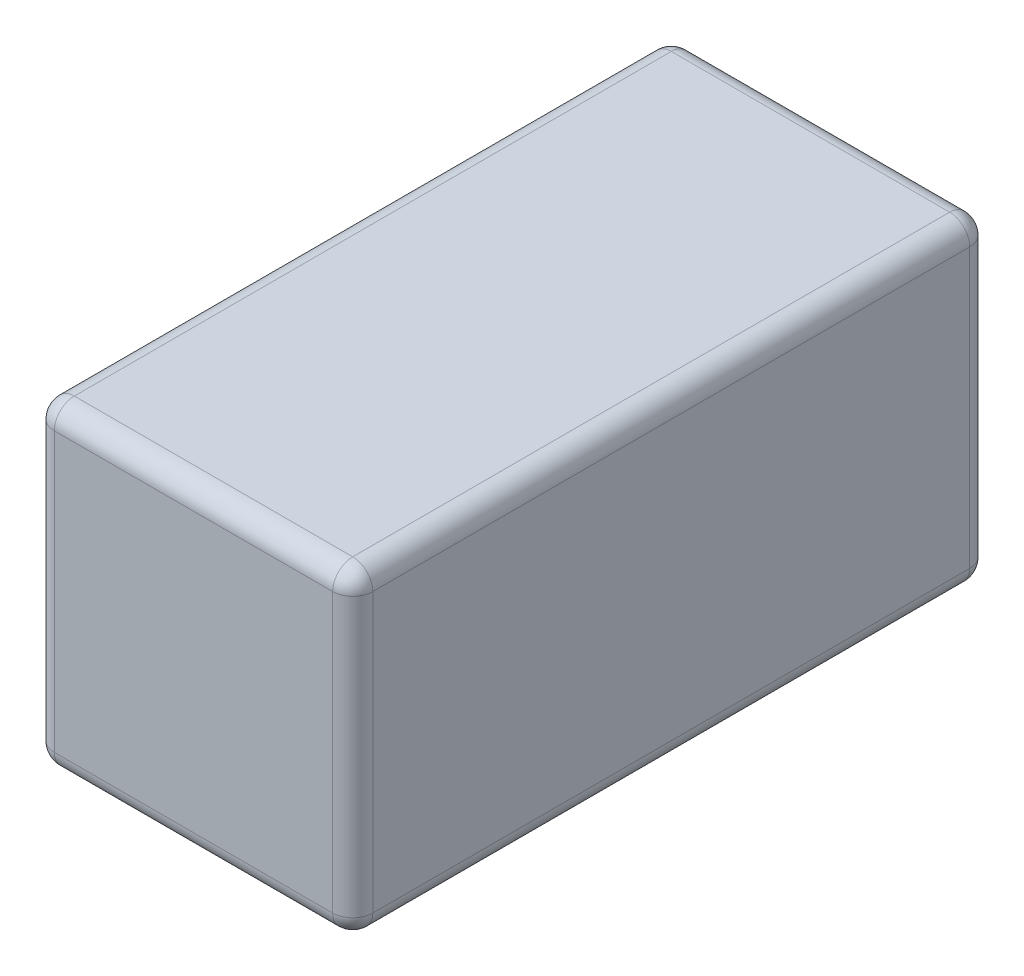
ISO-10303-21;
HEADER;
FILE_DESCRIPTION(('STEP AP214'),'2;1');
FILE_NAME('part.step','',(''),(''),'','','');
FILE_SCHEMA(('AUTOMOTIVE_DESIGN { 1 0 10303 214 1 1 1 1 }'));
ENDSEC;
DATA;
#1=APPLICATION_CONTEXT('core data for automotive mechanical design processes');
#2=APPLICATION_PROTOCOL_DEFINITION('international standard','automotive_design',2000,#1);
#3=PRODUCT_CONTEXT('',#1,'mechanical');
#4=PRODUCT('Part','Part','',(#3));
#5=PRODUCT_RELATED_PRODUCT_CATEGORY('part','',(#4));
#6=PRODUCT_DEFINITION_FORMATION('','',#4);
#7=PRODUCT_DEFINITION_CONTEXT('part definition',#1,'design');
#8=PRODUCT_DEFINITION('design','',#6,#7);
#9=PRODUCT_DEFINITION_SHAPE('','',#8);
#10=(LENGTH_UNIT() NAMED_UNIT(*) SI_UNIT(.MILLI.,.METRE.));
#11=(NAMED_UNIT(*) PLANE_ANGLE_UNIT() SI_UNIT($,.RADIAN.));
#12=(NAMED_UNIT(*) SI_UNIT($,.STERADIAN.) SOLID_ANGLE_UNIT());
#13=UNCERTAINTY_MEASURE_WITH_UNIT(LENGTH_MEASURE(1.E-05),#10,'distance_accuracy_value','');
#14=(GEOMETRIC_REPRESENTATION_CONTEXT(3) GLOBAL_UNCERTAINTY_ASSIGNED_CONTEXT((#13)) GLOBAL_UNIT_ASSIGNED_CONTEXT((#10,
#11,#12)) REPRESENTATION_CONTEXT('',''));
#15=CARTESIAN_POINT('',(0.,0.,0.));
#16=DIRECTION('',(0.,0.,1.));
#17=DIRECTION('',(1.,0.,0.));
#18=AXIS2_PLACEMENT_3D('',#15,#16,#17);
#19=CARTESIAN_POINT('',(0.79375,-0.79375,3.175));
#20=DIRECTION('',(-1.,0.,0.));
#21=DIRECTION('',(0.,0.,1.));
#22=AXIS2_PLACEMENT_3D('',#19,#20,#21);
#23=PLANE('',#22);
#24=DIRECTION('',(0.,1.,0.));
#25=VECTOR('',#24,1.);
#26=CARTESIAN_POINT('',(0.79375,-0.79375,3.075));
#27=LINE('',#26,#25);
#28=CARTESIAN_POINT('',(0.79375,0.69375,3.075));
#29=VERTEX_POINT('',#28);
#30=CARTESIAN_POINT('',(0.79375,-0.69375,3.075));
#31=VERTEX_POINT('',#30);
#32=EDGE_CURVE('E189',#29,#31,#27,.F.);
#33=ORIENTED_EDGE('',*,*,#32,.T.);
#34=DIRECTION('',(0.,0.,-1.));
#35=VECTOR('',#34,1.);
#36=CARTESIAN_POINT('',(0.79375,-0.69375,3.175));
#37=LINE('',#36,#35);
#38=CARTESIAN_POINT('',(0.79375,-0.69375,0.0999999999999998));
#39=VERTEX_POINT('',#38);
#40=EDGE_CURVE('E143',#31,#39,#37,.T.);
#41=ORIENTED_EDGE('',*,*,#40,.T.);
#42=DIRECTION('',(0.,1.,0.));
#43=VECTOR('',#42,1.);
#44=CARTESIAN_POINT('',(0.79375,0.79375,0.0999999999999998));
#45=LINE('',#44,#43);
#46=CARTESIAN_POINT('',(0.79375,0.69375,0.0999999999999998));
#47=VERTEX_POINT('',#46);
#48=EDGE_CURVE('E191',#39,#47,#45,.T.);
#49=ORIENTED_EDGE('',*,*,#48,.T.);
#50=DIRECTION('',(0.,0.,-1.));
#51=VECTOR('',#50,1.);
#52=CARTESIAN_POINT('',(0.79375,0.69375,3.175));
#53=LINE('',#52,#51);
#54=EDGE_CURVE('E187',#47,#29,#53,.F.);
#55=ORIENTED_EDGE('',*,*,#54,.T.);
#56=EDGE_LOOP('',(#33,#41,#49,#55));
#57=FACE_BOUND('',#56,.T.);
#58=ADVANCED_FACE('F37',(#57),#23,.F.);
#59=CARTESIAN_POINT('',(-0.79375,0.79375,3.175));
#60=DIRECTION('',(0.,-1.,0.));
#61=DIRECTION('',(0.,0.,-1.));
#62=AXIS2_PLACEMENT_3D('',#59,#60,#61);
#63=PLANE('',#62);
#64=DIRECTION('',(-1.,0.,0.));
#65=VECTOR('',#64,1.);
#66=CARTESIAN_POINT('',(-0.79375,0.79375,3.075));
#67=LINE('',#66,#65);
#68=CARTESIAN_POINT('',(-0.69375,0.79375,3.075));
#69=VERTEX_POINT('',#68);
#70=CARTESIAN_POINT('',(0.69375,0.79375,3.075));
#71=VERTEX_POINT('',#70);
#72=EDGE_CURVE('E46',#69,#71,#67,.F.);
#73=ORIENTED_EDGE('',*,*,#72,.T.);
#74=DIRECTION('',(0.,0.,-1.));
#75=VECTOR('',#74,1.);
#76=CARTESIAN_POINT('',(0.69375,0.79375,3.175));
#77=LINE('',#76,#75);
#78=CARTESIAN_POINT('',(0.69375,0.79375,0.0999999999999998));
#79=VERTEX_POINT('',#78);
#80=EDGE_CURVE('E11',#71,#79,#77,.T.);
#81=ORIENTED_EDGE('',*,*,#80,.T.);
#82=DIRECTION('',(-1.,0.,0.));
#83=VECTOR('',#82,1.);
#84=CARTESIAN_POINT('',(-0.79375,0.79375,0.0999999999999998));
#85=LINE('',#84,#83);
#86=CARTESIAN_POINT('',(-0.69375,0.79375,0.0999999999999998));
#87=VERTEX_POINT('',#86);
#88=EDGE_CURVE('E203',#79,#87,#85,.T.);
#89=ORIENTED_EDGE('',*,*,#88,.T.);
#90=DIRECTION('',(0.,0.,-1.));
#91=VECTOR('',#90,1.);
#92=CARTESIAN_POINT('',(-0.69375,0.79375,3.175));
#93=LINE('',#92,#91);
#94=EDGE_CURVE('E57',#87,#69,#93,.F.);
#95=ORIENTED_EDGE('',*,*,#94,.T.);
#96=EDGE_LOOP('',(#73,#81,#89,#95));
#97=FACE_BOUND('',#96,.T.);
#98=ADVANCED_FACE('F276',(#97),#63,.F.);
#99=CARTESIAN_POINT('',(-0.79375,-0.79375,3.175));
#100=DIRECTION('',(1.,0.,0.));
#101=DIRECTION('',(0.,0.,-1.));
#102=AXIS2_PLACEMENT_3D('',#99,#100,#101);
#103=PLANE('',#102);
#104=DIRECTION('',(0.,-1.,0.));
#105=VECTOR('',#104,1.);
#106=CARTESIAN_POINT('',(-0.79375,-0.79375,0.0999999999999998));
#107=LINE('',#106,#105);
#108=CARTESIAN_POINT('',(-0.79375,0.69375,0.0999999999999998));
#109=VERTEX_POINT('',#108);
#110=CARTESIAN_POINT('',(-0.79375,-0.69375,0.0999999999999998));
#111=VERTEX_POINT('',#110);
#112=EDGE_CURVE('E169',#109,#111,#107,.T.);
#113=ORIENTED_EDGE('',*,*,#112,.T.);
#114=DIRECTION('',(0.,0.,-1.));
#115=VECTOR('',#114,1.);
#116=CARTESIAN_POINT('',(-0.79375,-0.69375,3.175));
#117=LINE('',#116,#115);
#118=CARTESIAN_POINT('',(-0.79375,-0.69375,3.075));
#119=VERTEX_POINT('',#118);
#120=EDGE_CURVE('E175',#111,#119,#117,.F.);
#121=ORIENTED_EDGE('',*,*,#120,.T.);
#122=DIRECTION('',(0.,-1.,0.));
#123=VECTOR('',#122,1.);
#124=CARTESIAN_POINT('',(-0.79375,-0.79375,3.075));
#125=LINE('',#124,#123);
#126=CARTESIAN_POINT('',(-0.79375,0.69375,3.075));
#127=VERTEX_POINT('',#126);
#128=EDGE_CURVE('E173',#119,#127,#125,.F.);
#129=ORIENTED_EDGE('',*,*,#128,.T.);
#130=DIRECTION('',(0.,0.,-1.));
#131=VECTOR('',#130,1.);
#132=CARTESIAN_POINT('',(-0.79375,0.69375,3.175));
#133=LINE('',#132,#131);
#134=EDGE_CURVE('E171',#127,#109,#133,.T.);
#135=ORIENTED_EDGE('',*,*,#134,.T.);
#136=EDGE_LOOP('',(#113,#121,#129,#135));
#137=FACE_BOUND('',#136,.T.);
#138=ADVANCED_FACE('F336',(#137),#103,.F.);
#139=CARTESIAN_POINT('',(-0.79375,-0.79375,3.175));
#140=DIRECTION('',(0.,1.,0.));
#141=DIRECTION('',(0.,0.,1.));
#142=AXIS2_PLACEMENT_3D('',#139,#140,#141);
#143=PLANE('',#142);
#144=DIRECTION('',(1.,0.,0.));
#145=VECTOR('',#144,1.);
#146=CARTESIAN_POINT('',(-0.79375,-0.79375,3.075));
#147=LINE('',#146,#145);
#148=CARTESIAN_POINT('',(0.69375,-0.79375,3.075));
#149=VERTEX_POINT('',#148);
#150=CARTESIAN_POINT('',(-0.69375,-0.79375,3.075));
#151=VERTEX_POINT('',#150);
#152=EDGE_CURVE('E129',#149,#151,#147,.F.);
#153=ORIENTED_EDGE('',*,*,#152,.T.);
#154=DIRECTION('',(0.,0.,-1.));
#155=VECTOR('',#154,1.);
#156=CARTESIAN_POINT('',(-0.69375,-0.79375,3.175));
#157=LINE('',#156,#155);
#158=CARTESIAN_POINT('',(-0.69375,-0.79375,0.0999999999999998));
#159=VERTEX_POINT('',#158);
#160=EDGE_CURVE('E167',#151,#159,#157,.T.);
#161=ORIENTED_EDGE('',*,*,#160,.T.);
#162=DIRECTION('',(1.,0.,0.));
#163=VECTOR('',#162,1.);
#164=CARTESIAN_POINT('',(0.79375,-0.79375,0.0999999999999998));
#165=LINE('',#164,#163);
#166=CARTESIAN_POINT('',(0.69375,-0.79375,0.0999999999999998));
#167=VERTEX_POINT('',#166);
#168=EDGE_CURVE('E132',#159,#167,#165,.T.);
#169=ORIENTED_EDGE('',*,*,#168,.T.);
#170=DIRECTION('',(0.,0.,-1.));
#171=VECTOR('',#170,1.);
#172=CARTESIAN_POINT('',(0.69375,-0.79375,3.175));
#173=LINE('',#172,#171);
#174=EDGE_CURVE('E124',#167,#149,#173,.F.);
#175=ORIENTED_EDGE('',*,*,#174,.T.);
#176=EDGE_LOOP('',(#153,#161,#169,#175));
#177=FACE_BOUND('',#176,.T.);
#178=ADVANCED_FACE('F126',(#177),#143,.F.);
#179=CARTESIAN_POINT('',(0.,0.,3.175));
#180=DIRECTION('',(0.,0.,-1.));
#181=DIRECTION('',(-1.,0.,0.));
#182=AXIS2_PLACEMENT_3D('',#179,#180,#181);
#183=PLANE('',#182);
#184=DIRECTION('',(0.,-1.,0.));
#185=VECTOR('',#184,1.);
#186=CARTESIAN_POINT('',(-0.69375,0.,3.175));
#187=LINE('',#186,#185);
#188=CARTESIAN_POINT('',(-0.69375,0.69375,3.175));
#189=VERTEX_POINT('',#188);
#190=CARTESIAN_POINT('',(-0.69375,-0.69375,3.175));
#191=VERTEX_POINT('',#190);
#192=EDGE_CURVE('E198',#189,#191,#187,.T.);
#193=ORIENTED_EDGE('',*,*,#192,.T.);
#194=DIRECTION('',(1.,0.,0.));
#195=VECTOR('',#194,1.);
#196=CARTESIAN_POINT('',(0.,-0.69375,3.175));
#197=LINE('',#196,#195);
#198=CARTESIAN_POINT('',(0.69375,-0.69375,3.175));
#199=VERTEX_POINT('',#198);
#200=EDGE_CURVE('E200',#191,#199,#197,.T.);
#201=ORIENTED_EDGE('',*,*,#200,.T.);
#202=DIRECTION('',(0.,1.,0.));
#203=VECTOR('',#202,1.);
#204=CARTESIAN_POINT('',(0.69375,0.,3.175));
#205=LINE('',#204,#203);
#206=CARTESIAN_POINT('',(0.69375,0.69375,3.175));
#207=VERTEX_POINT('',#206);
#208=EDGE_CURVE('E196',#199,#207,#205,.T.);
#209=ORIENTED_EDGE('',*,*,#208,.T.);
#210=DIRECTION('',(-1.,0.,0.));
#211=VECTOR('',#210,1.);
#212=CARTESIAN_POINT('',(0.,0.69375,3.175));
#213=LINE('',#212,#211);
#214=EDGE_CURVE('E194',#207,#189,#213,.T.);
#215=ORIENTED_EDGE('',*,*,#214,.T.);
#216=EDGE_LOOP('',(#193,#201,#209,#215));
#217=FACE_BOUND('',#216,.T.);
#218=ADVANCED_FACE('F301',(#217),#183,.F.);
#219=CARTESIAN_POINT('',(0.,0.,0.));
#220=DIRECTION('',(0.,0.,-1.));
#221=DIRECTION('',(-1.,0.,0.));
#222=AXIS2_PLACEMENT_3D('',#219,#220,#221);
#223=PLANE('',#222);
#224=DIRECTION('',(0.,1.,0.));
#225=VECTOR('',#224,1.);
#226=CARTESIAN_POINT('',(0.69375,-0.79375,0.));
#227=LINE('',#226,#225);
#228=CARTESIAN_POINT('',(0.69375,0.69375,0.));
#229=VERTEX_POINT('',#228);
#230=CARTESIAN_POINT('',(0.69375,-0.69375,0.));
#231=VERTEX_POINT('',#230);
#232=EDGE_CURVE('E182',#229,#231,#227,.F.);
#233=ORIENTED_EDGE('',*,*,#232,.T.);
#234=DIRECTION('',(1.,0.,0.));
#235=VECTOR('',#234,1.);
#236=CARTESIAN_POINT('',(-0.79375,-0.69375,0.));
#237=LINE('',#236,#235);
#238=CARTESIAN_POINT('',(-0.69375,-0.69375,0.));
#239=VERTEX_POINT('',#238);
#240=EDGE_CURVE('E184',#231,#239,#237,.F.);
#241=ORIENTED_EDGE('',*,*,#240,.T.);
#242=DIRECTION('',(0.,-1.,0.));
#243=VECTOR('',#242,1.);
#244=CARTESIAN_POINT('',(-0.69375,0.79375,0.));
#245=LINE('',#244,#243);
#246=CARTESIAN_POINT('',(-0.69375,0.69375,0.));
#247=VERTEX_POINT('',#246);
#248=EDGE_CURVE('E178',#239,#247,#245,.F.);
#249=ORIENTED_EDGE('',*,*,#248,.T.);
#250=DIRECTION('',(-1.,0.,0.));
#251=VECTOR('',#250,1.);
#252=CARTESIAN_POINT('',(0.79375,0.69375,0.));
#253=LINE('',#252,#251);
#254=EDGE_CURVE('E180',#247,#229,#253,.F.);
#255=ORIENTED_EDGE('',*,*,#254,.T.);
#256=EDGE_LOOP('',(#233,#241,#249,#255));
#257=FACE_BOUND('',#256,.T.);
#258=ADVANCED_FACE('F269',(#257),#223,.T.);
#259=CARTESIAN_POINT('',(0.69375,0.69375,3.175));
#260=DIRECTION('',(0.,0.,-1.));
#261=DIRECTION('',(-1.,0.,0.));
#262=AXIS2_PLACEMENT_3D('',#259,#260,#261);
#263=CYLINDRICAL_SURFACE('',#262,0.1);
#264=CARTESIAN_POINT('',(0.69375,0.69375,3.075));
#265=DIRECTION('',(0.,0.,1.));
#266=DIRECTION('',(1.,0.,0.));
#267=AXIS2_PLACEMENT_3D('',#264,#265,#266);
#268=CIRCLE('',#267,0.1);
#269=EDGE_CURVE('E41',#29,#71,#268,.T.);
#270=ORIENTED_EDGE('',*,*,#269,.F.);
#271=ORIENTED_EDGE('',*,*,#54,.F.);
#272=CARTESIAN_POINT('',(0.69375,0.69375,0.0999999999999998));
#273=DIRECTION('',(0.,0.,-1.));
#274=DIRECTION('',(-1.,0.,0.));
#275=AXIS2_PLACEMENT_3D('',#272,#273,#274);
#276=CIRCLE('',#275,0.1);
#277=EDGE_CURVE('E164',#79,#47,#276,.T.);
#278=ORIENTED_EDGE('',*,*,#277,.F.);
#279=ORIENTED_EDGE('',*,*,#80,.F.);
#280=EDGE_LOOP('',(#270,#271,#278,#279));
#281=FACE_BOUND('',#280,.T.);
#282=ADVANCED_FACE('F39',(#281),#263,.T.);
#283=CARTESIAN_POINT('',(0.69375,0.69375,3.075));
#284=DIRECTION('',(0.,1.,0.));
#285=DIRECTION('',(0.,0.,1.));
#286=AXIS2_PLACEMENT_3D('',#283,#284,#285);
#287=SPHERICAL_SURFACE('',#286,0.1);
#288=CARTESIAN_POINT('',(0.69375,0.69375,3.075));
#289=DIRECTION('',(0.,1.,0.));
#290=DIRECTION('',(0.,0.,1.));
#291=AXIS2_PLACEMENT_3D('',#288,#289,#290);
#292=CIRCLE('',#291,0.1);
#293=EDGE_CURVE('E249',#29,#207,#292,.F.);
#294=ORIENTED_EDGE('',*,*,#293,.F.);
#295=ORIENTED_EDGE('',*,*,#269,.T.);
#296=CARTESIAN_POINT('',(0.69375,0.69375,3.075));
#297=DIRECTION('',(1.,0.,0.));
#298=DIRECTION('',(0.,0.,-1.));
#299=AXIS2_PLACEMENT_3D('',#296,#297,#298);
#300=CIRCLE('',#299,0.1);
#301=EDGE_CURVE('E252',#207,#71,#300,.F.);
#302=ORIENTED_EDGE('',*,*,#301,.F.);
#303=EDGE_LOOP('',(#294,#295,#302));
#304=FACE_BOUND('',#303,.T.);
#305=ADVANCED_FACE('F294',(#304),#287,.T.);
#306=CARTESIAN_POINT('',(0.69375,0.69375,0.1));
#307=DIRECTION('',(1.,0.,0.));
#308=DIRECTION('',(0.,0.,-1.));
#309=AXIS2_PLACEMENT_3D('',#306,#307,#308);
#310=SPHERICAL_SURFACE('',#309,0.1);
#311=CARTESIAN_POINT('',(0.69375,0.69375,0.1));
#312=DIRECTION('',(1.,0.,0.));
#313=DIRECTION('',(0.,0.,-1.));
#314=AXIS2_PLACEMENT_3D('',#311,#312,#313);
#315=CIRCLE('',#314,0.1);
#316=EDGE_CURVE('E243',#79,#229,#315,.F.);
#317=ORIENTED_EDGE('',*,*,#316,.F.);
#318=ORIENTED_EDGE('',*,*,#277,.T.);
#319=CARTESIAN_POINT('',(0.69375,0.69375,0.0999999999999998));
#320=DIRECTION('',(0.,1.,0.));
#321=DIRECTION('',(0.,0.,1.));
#322=AXIS2_PLACEMENT_3D('',#319,#320,#321);
#323=CIRCLE('',#322,0.1);
#324=EDGE_CURVE('E246',#229,#47,#323,.F.);
#325=ORIENTED_EDGE('',*,*,#324,.F.);
#326=EDGE_LOOP('',(#317,#318,#325));
#327=FACE_BOUND('',#326,.T.);
#328=ADVANCED_FACE('F259',(#327),#310,.T.);
#329=CARTESIAN_POINT('',(0.,0.69375,3.075));
#330=DIRECTION('',(-1.,0.,0.));
#331=DIRECTION('',(0.,0.,1.));
#332=AXIS2_PLACEMENT_3D('',#329,#330,#331);
#333=CYLINDRICAL_SURFACE('',#332,0.1);
#334=ORIENTED_EDGE('',*,*,#301,.T.);
#335=ORIENTED_EDGE('',*,*,#72,.F.);
#336=CARTESIAN_POINT('',(-0.69375,0.69375,3.075));
#337=DIRECTION('',(-1.,0.,0.));
#338=DIRECTION('',(0.,0.,1.));
#339=AXIS2_PLACEMENT_3D('',#336,#337,#338);
#340=CIRCLE('',#339,0.1);
#341=EDGE_CURVE('E237',#189,#69,#340,.T.);
#342=ORIENTED_EDGE('',*,*,#341,.F.);
#343=ORIENTED_EDGE('',*,*,#214,.F.);
#344=EDGE_LOOP('',(#334,#335,#342,#343));
#345=FACE_BOUND('',#344,.T.);
#346=ADVANCED_FACE('F290',(#345),#333,.T.);
#347=CARTESIAN_POINT('',(0.69375,0.,3.075));
#348=DIRECTION('',(0.,1.,0.));
#349=DIRECTION('',(0.,0.,1.));
#350=AXIS2_PLACEMENT_3D('',#347,#348,#349);
#351=CYLINDRICAL_SURFACE('',#350,0.1);
#352=ORIENTED_EDGE('',*,*,#293,.T.);
#353=ORIENTED_EDGE('',*,*,#208,.F.);
#354=CARTESIAN_POINT('',(0.69375,-0.69375,3.075));
#355=DIRECTION('',(0.,-1.,0.));
#356=DIRECTION('',(0.,0.,-1.));
#357=AXIS2_PLACEMENT_3D('',#354,#355,#356);
#358=CIRCLE('',#357,0.1);
#359=EDGE_CURVE('E147',#31,#199,#358,.T.);
#360=ORIENTED_EDGE('',*,*,#359,.F.);
#361=ORIENTED_EDGE('',*,*,#32,.F.);
#362=EDGE_LOOP('',(#352,#353,#360,#361));
#363=FACE_BOUND('',#362,.T.);
#364=ADVANCED_FACE('F299',(#363),#351,.T.);
#365=CARTESIAN_POINT('',(0.69375,-0.69375,3.175));
#366=DIRECTION('',(0.,0.,-1.));
#367=DIRECTION('',(-1.,0.,0.));
#368=AXIS2_PLACEMENT_3D('',#365,#366,#367);
#369=CYLINDRICAL_SURFACE('',#368,0.1);
#370=CARTESIAN_POINT('',(0.69375,-0.69375,0.0999999999999998));
#371=DIRECTION('',(0.,0.,-1.));
#372=DIRECTION('',(-1.,0.,0.));
#373=AXIS2_PLACEMENT_3D('',#370,#371,#372);
#374=CIRCLE('',#373,0.1);
#375=EDGE_CURVE('E148',#39,#167,#374,.T.);
#376=ORIENTED_EDGE('',*,*,#375,.F.);
#377=ORIENTED_EDGE('',*,*,#40,.F.);
#378=CARTESIAN_POINT('',(0.69375,-0.69375,3.075));
#379=DIRECTION('',(0.,0.,1.));
#380=DIRECTION('',(1.,0.,0.));
#381=AXIS2_PLACEMENT_3D('',#378,#379,#380);
#382=CIRCLE('',#381,0.1);
#383=EDGE_CURVE('E139',#149,#31,#382,.T.);
#384=ORIENTED_EDGE('',*,*,#383,.F.);
#385=ORIENTED_EDGE('',*,*,#174,.F.);
#386=EDGE_LOOP('',(#376,#377,#384,#385));
#387=FACE_BOUND('',#386,.T.);
#388=ADVANCED_FACE('F141',(#387),#369,.T.);
#389=CARTESIAN_POINT('',(0.69375,-0.79375,0.0999999999999998));
#390=DIRECTION('',(0.,-1.,0.));
#391=DIRECTION('',(0.,0.,-1.));
#392=AXIS2_PLACEMENT_3D('',#389,#390,#391);
#393=CYLINDRICAL_SURFACE('',#392,0.1);
#394=ORIENTED_EDGE('',*,*,#324,.T.);
#395=ORIENTED_EDGE('',*,*,#48,.F.);
#396=CARTESIAN_POINT('',(0.69375,-0.69375,0.1));
#397=DIRECTION('',(0.,-1.,0.));
#398=DIRECTION('',(0.,0.,-1.));
#399=AXIS2_PLACEMENT_3D('',#396,#397,#398);
#400=CIRCLE('',#399,0.1);
#401=EDGE_CURVE('E233',#231,#39,#400,.T.);
#402=ORIENTED_EDGE('',*,*,#401,.F.);
#403=ORIENTED_EDGE('',*,*,#232,.F.);
#404=EDGE_LOOP('',(#394,#395,#402,#403));
#405=FACE_BOUND('',#404,.T.);
#406=ADVANCED_FACE('F265',(#405),#393,.T.);
#407=CARTESIAN_POINT('',(-0.79375,0.69375,0.0999999999999998));
#408=DIRECTION('',(1.,0.,0.));
#409=DIRECTION('',(0.,0.,-1.));
#410=AXIS2_PLACEMENT_3D('',#407,#408,#409);
#411=CYLINDRICAL_SURFACE('',#410,0.1);
#412=ORIENTED_EDGE('',*,*,#316,.T.);
#413=ORIENTED_EDGE('',*,*,#254,.F.);
#414=CARTESIAN_POINT('',(-0.69375,0.69375,0.0999999999999998));
#415=DIRECTION('',(-1.,0.,0.));
#416=DIRECTION('',(0.,0.,1.));
#417=AXIS2_PLACEMENT_3D('',#414,#415,#416);
#418=CIRCLE('',#417,0.1);
#419=EDGE_CURVE('E230',#87,#247,#418,.T.);
#420=ORIENTED_EDGE('',*,*,#419,.F.);
#421=ORIENTED_EDGE('',*,*,#88,.F.);
#422=EDGE_LOOP('',(#412,#413,#420,#421));
#423=FACE_BOUND('',#422,.T.);
#424=ADVANCED_FACE('F275',(#423),#411,.T.);
#425=CARTESIAN_POINT('',(-0.69375,0.69375,3.175));
#426=DIRECTION('',(0.,0.,-1.));
#427=DIRECTION('',(-1.,0.,0.));
#428=AXIS2_PLACEMENT_3D('',#425,#426,#427);
#429=CYLINDRICAL_SURFACE('',#428,0.1);
#430=CARTESIAN_POINT('',(-0.69375,0.69375,3.075));
#431=DIRECTION('',(0.,0.,1.));
#432=DIRECTION('',(1.,0.,0.));
#433=AXIS2_PLACEMENT_3D('',#430,#431,#432);
#434=CIRCLE('',#433,0.1);
#435=EDGE_CURVE('E240',#69,#127,#434,.T.);
#436=ORIENTED_EDGE('',*,*,#435,.F.);
#437=ORIENTED_EDGE('',*,*,#94,.F.);
#438=CARTESIAN_POINT('',(-0.69375,0.69375,0.0999999999999998));
#439=DIRECTION('',(0.,0.,-1.));
#440=DIRECTION('',(-1.,0.,0.));
#441=AXIS2_PLACEMENT_3D('',#438,#439,#440);
#442=CIRCLE('',#441,0.1);
#443=EDGE_CURVE('E227',#109,#87,#442,.T.);
#444=ORIENTED_EDGE('',*,*,#443,.F.);
#445=ORIENTED_EDGE('',*,*,#134,.F.);
#446=EDGE_LOOP('',(#436,#437,#444,#445));
#447=FACE_BOUND('',#446,.T.);
#448=ADVANCED_FACE('F280',(#447),#429,.T.);
#449=CARTESIAN_POINT('',(-0.69375,0.69375,3.075));
#450=DIRECTION('',(0.,1.,0.));
#451=DIRECTION('',(0.,0.,1.));
#452=AXIS2_PLACEMENT_3D('',#449,#450,#451);
#453=SPHERICAL_SURFACE('',#452,0.1);
#454=ORIENTED_EDGE('',*,*,#341,.T.);
#455=ORIENTED_EDGE('',*,*,#435,.T.);
#456=CARTESIAN_POINT('',(-0.69375,0.69375,3.075));
#457=DIRECTION('',(0.,1.,0.));
#458=DIRECTION('',(0.,0.,1.));
#459=AXIS2_PLACEMENT_3D('',#456,#457,#458);
#460=CIRCLE('',#459,0.1);
#461=EDGE_CURVE('E155',#189,#127,#460,.F.);
#462=ORIENTED_EDGE('',*,*,#461,.F.);
#463=EDGE_LOOP('',(#454,#455,#462));
#464=FACE_BOUND('',#463,.T.);
#465=ADVANCED_FACE('F286',(#464),#453,.T.);
#466=CARTESIAN_POINT('',(0.69375,-0.69375,3.075));
#467=DIRECTION('',(1.,0.,0.));
#468=DIRECTION('',(0.,0.,-1.));
#469=AXIS2_PLACEMENT_3D('',#466,#467,#468);
#470=SPHERICAL_SURFACE('',#469,0.1);
#471=ORIENTED_EDGE('',*,*,#383,.T.);
#472=ORIENTED_EDGE('',*,*,#359,.T.);
#473=CARTESIAN_POINT('',(0.69375,-0.69375,3.075));
#474=DIRECTION('',(1.,0.,0.));
#475=DIRECTION('',(0.,0.,-1.));
#476=AXIS2_PLACEMENT_3D('',#473,#474,#475);
#477=CIRCLE('',#476,0.1);
#478=EDGE_CURVE('E150',#149,#199,#477,.F.);
#479=ORIENTED_EDGE('',*,*,#478,.F.);
#480=EDGE_LOOP('',(#471,#472,#479));
#481=FACE_BOUND('',#480,.T.);
#482=ADVANCED_FACE('F151',(#481),#470,.T.);
#483=CARTESIAN_POINT('',(0.69375,-0.69375,0.1));
#484=DIRECTION('',(1.,0.,0.));
#485=DIRECTION('',(0.,0.,-1.));
#486=AXIS2_PLACEMENT_3D('',#483,#484,#485);
#487=SPHERICAL_SURFACE('',#486,0.1);
#488=ORIENTED_EDGE('',*,*,#401,.T.);
#489=ORIENTED_EDGE('',*,*,#375,.T.);
#490=CARTESIAN_POINT('',(0.69375,-0.69375,0.0999999999999998));
#491=DIRECTION('',(1.,0.,0.));
#492=DIRECTION('',(0.,0.,-1.));
#493=AXIS2_PLACEMENT_3D('',#490,#491,#492);
#494=CIRCLE('',#493,0.1);
#495=EDGE_CURVE('E156',#231,#167,#494,.F.);
#496=ORIENTED_EDGE('',*,*,#495,.F.);
#497=EDGE_LOOP('',(#488,#489,#496));
#498=FACE_BOUND('',#497,.T.);
#499=ADVANCED_FACE('F320',(#498),#487,.T.);
#500=CARTESIAN_POINT('',(-0.69375,0.69375,0.1));
#501=DIRECTION('',(0.,1.,0.));
#502=DIRECTION('',(0.,0.,1.));
#503=AXIS2_PLACEMENT_3D('',#500,#501,#502);
#504=SPHERICAL_SURFACE('',#503,0.1);
#505=ORIENTED_EDGE('',*,*,#443,.T.);
#506=ORIENTED_EDGE('',*,*,#419,.T.);
#507=CARTESIAN_POINT('',(-0.69375,0.69375,0.1));
#508=DIRECTION('',(0.,1.,0.));
#509=DIRECTION('',(0.,0.,1.));
#510=AXIS2_PLACEMENT_3D('',#507,#508,#509);
#511=CIRCLE('',#510,0.1);
#512=EDGE_CURVE('E220',#109,#247,#511,.F.);
#513=ORIENTED_EDGE('',*,*,#512,.F.);
#514=EDGE_LOOP('',(#505,#506,#513));
#515=FACE_BOUND('',#514,.T.);
#516=ADVANCED_FACE('F322',(#515),#504,.T.);
#517=CARTESIAN_POINT('',(-0.69375,0.,3.075));
#518=DIRECTION('',(0.,-1.,0.));
#519=DIRECTION('',(0.,0.,-1.));
#520=AXIS2_PLACEMENT_3D('',#517,#518,#519);
#521=CYLINDRICAL_SURFACE('',#520,0.1);
#522=ORIENTED_EDGE('',*,*,#461,.T.);
#523=ORIENTED_EDGE('',*,*,#128,.F.);
#524=CARTESIAN_POINT('',(-0.69375,-0.69375,3.075));
#525=DIRECTION('',(0.,-1.,0.));
#526=DIRECTION('',(0.,0.,-1.));
#527=AXIS2_PLACEMENT_3D('',#524,#525,#526);
#528=CIRCLE('',#527,0.1);
#529=EDGE_CURVE('E217',#191,#119,#528,.T.);
#530=ORIENTED_EDGE('',*,*,#529,.F.);
#531=ORIENTED_EDGE('',*,*,#192,.F.);
#532=EDGE_LOOP('',(#522,#523,#530,#531));
#533=FACE_BOUND('',#532,.T.);
#534=ADVANCED_FACE('F305',(#533),#521,.T.);
#535=CARTESIAN_POINT('',(0.,-0.69375,3.075));
#536=DIRECTION('',(1.,0.,0.));
#537=DIRECTION('',(0.,0.,-1.));
#538=AXIS2_PLACEMENT_3D('',#535,#536,#537);
#539=CYLINDRICAL_SURFACE('',#538,0.1);
#540=ORIENTED_EDGE('',*,*,#478,.T.);
#541=ORIENTED_EDGE('',*,*,#200,.F.);
#542=CARTESIAN_POINT('',(-0.69375,-0.69375,3.075));
#543=DIRECTION('',(-1.,0.,0.));
#544=DIRECTION('',(0.,0.,1.));
#545=AXIS2_PLACEMENT_3D('',#542,#543,#544);
#546=CIRCLE('',#545,0.1);
#547=EDGE_CURVE('E160',#151,#191,#546,.T.);
#548=ORIENTED_EDGE('',*,*,#547,.F.);
#549=ORIENTED_EDGE('',*,*,#152,.F.);
#550=EDGE_LOOP('',(#540,#541,#548,#549));
#551=FACE_BOUND('',#550,.T.);
#552=ADVANCED_FACE('F158',(#551),#539,.T.);
#553=CARTESIAN_POINT('',(-0.79375,-0.69375,0.0999999999999998));
#554=DIRECTION('',(-1.,0.,0.));
#555=DIRECTION('',(0.,0.,1.));
#556=AXIS2_PLACEMENT_3D('',#553,#554,#555);
#557=CYLINDRICAL_SURFACE('',#556,0.1);
#558=ORIENTED_EDGE('',*,*,#495,.T.);
#559=ORIENTED_EDGE('',*,*,#168,.F.);
#560=CARTESIAN_POINT('',(-0.69375,-0.69375,0.1));
#561=DIRECTION('',(-1.,0.,0.));
#562=DIRECTION('',(0.,0.,1.));
#563=AXIS2_PLACEMENT_3D('',#560,#561,#562);
#564=CIRCLE('',#563,0.1);
#565=EDGE_CURVE('E213',#239,#159,#564,.T.);
#566=ORIENTED_EDGE('',*,*,#565,.F.);
#567=ORIENTED_EDGE('',*,*,#240,.F.);
#568=EDGE_LOOP('',(#558,#559,#566,#567));
#569=FACE_BOUND('',#568,.T.);
#570=ADVANCED_FACE('F318',(#569),#557,.T.);
#571=CARTESIAN_POINT('',(-0.69375,-0.79375,0.0999999999999998));
#572=DIRECTION('',(0.,1.,0.));
#573=DIRECTION('',(0.,0.,1.));
#574=AXIS2_PLACEMENT_3D('',#571,#572,#573);
#575=CYLINDRICAL_SURFACE('',#574,0.1);
#576=ORIENTED_EDGE('',*,*,#512,.T.);
#577=ORIENTED_EDGE('',*,*,#248,.F.);
#578=CARTESIAN_POINT('',(-0.69375,-0.69375,0.0999999999999998));
#579=DIRECTION('',(0.,-1.,0.));
#580=DIRECTION('',(0.,0.,-1.));
#581=AXIS2_PLACEMENT_3D('',#578,#579,#580);
#582=CIRCLE('',#581,0.1);
#583=EDGE_CURVE('E211',#111,#239,#582,.T.);
#584=ORIENTED_EDGE('',*,*,#583,.F.);
#585=ORIENTED_EDGE('',*,*,#112,.F.);
#586=EDGE_LOOP('',(#576,#577,#584,#585));
#587=FACE_BOUND('',#586,.T.);
#588=ADVANCED_FACE('F346',(#587),#575,.T.);
#589=CARTESIAN_POINT('',(-0.69375,-0.69375,3.075));
#590=DIRECTION('',(0.,0.,1.));
#591=DIRECTION('',(1.,0.,0.));
#592=AXIS2_PLACEMENT_3D('',#589,#590,#591);
#593=SPHERICAL_SURFACE('',#592,0.1);
#594=ORIENTED_EDGE('',*,*,#547,.T.);
#595=ORIENTED_EDGE('',*,*,#529,.T.);
#596=CARTESIAN_POINT('',(-0.69375,-0.69375,3.075));
#597=DIRECTION('',(0.,0.,1.));
#598=DIRECTION('',(1.,0.,0.));
#599=AXIS2_PLACEMENT_3D('',#596,#597,#598);
#600=CIRCLE('',#599,0.1);
#601=EDGE_CURVE('E209',#151,#119,#600,.F.);
#602=ORIENTED_EDGE('',*,*,#601,.F.);
#603=EDGE_LOOP('',(#594,#595,#602));
#604=FACE_BOUND('',#603,.T.);
#605=ADVANCED_FACE('F307',(#604),#593,.T.);
#606=CARTESIAN_POINT('',(-0.69375,-0.69375,0.1));
#607=DIRECTION('',(0.,0.,-1.));
#608=DIRECTION('',(-1.,0.,0.));
#609=AXIS2_PLACEMENT_3D('',#606,#607,#608);
#610=SPHERICAL_SURFACE('',#609,0.1);
#611=ORIENTED_EDGE('',*,*,#583,.T.);
#612=ORIENTED_EDGE('',*,*,#565,.T.);
#613=CARTESIAN_POINT('',(-0.69375,-0.69375,0.0999999999999998));
#614=DIRECTION('',(0.,0.,-1.));
#615=DIRECTION('',(-1.,0.,0.));
#616=AXIS2_PLACEMENT_3D('',#613,#614,#615);
#617=CIRCLE('',#616,0.1);
#618=EDGE_CURVE('E207',#111,#159,#617,.F.);
#619=ORIENTED_EDGE('',*,*,#618,.F.);
#620=EDGE_LOOP('',(#611,#612,#619));
#621=FACE_BOUND('',#620,.T.);
#622=ADVANCED_FACE('F315',(#621),#610,.T.);
#623=CARTESIAN_POINT('',(-0.69375,-0.69375,3.175));
#624=DIRECTION('',(0.,0.,-1.));
#625=DIRECTION('',(-1.,0.,0.));
#626=AXIS2_PLACEMENT_3D('',#623,#624,#625);
#627=CYLINDRICAL_SURFACE('',#626,0.1);
#628=ORIENTED_EDGE('',*,*,#601,.T.);
#629=ORIENTED_EDGE('',*,*,#120,.F.);
#630=ORIENTED_EDGE('',*,*,#618,.T.);
#631=ORIENTED_EDGE('',*,*,#160,.F.);
#632=EDGE_LOOP('',(#628,#629,#630,#631));
#633=FACE_BOUND('',#632,.T.);
#634=ADVANCED_FACE('F311',(#633),#627,.T.);
#635=CLOSED_SHELL('',(#58,#98,#138,#178,#218,#258,#282,#305,#328,#346,#364,#388,#406,#424,#448,
#465,#482,#499,#516,#534,#552,#570,#588,#605,#622,#634));
#636=MANIFOLD_SOLID_BREP('B2',#635);
#637=ADVANCED_BREP_SHAPE_REPRESENTATION('',(#18,#636),#14);
#638=SHAPE_DEFINITION_REPRESENTATION(#9,#637);
ENDSEC;
END-ISO-10303-21;
